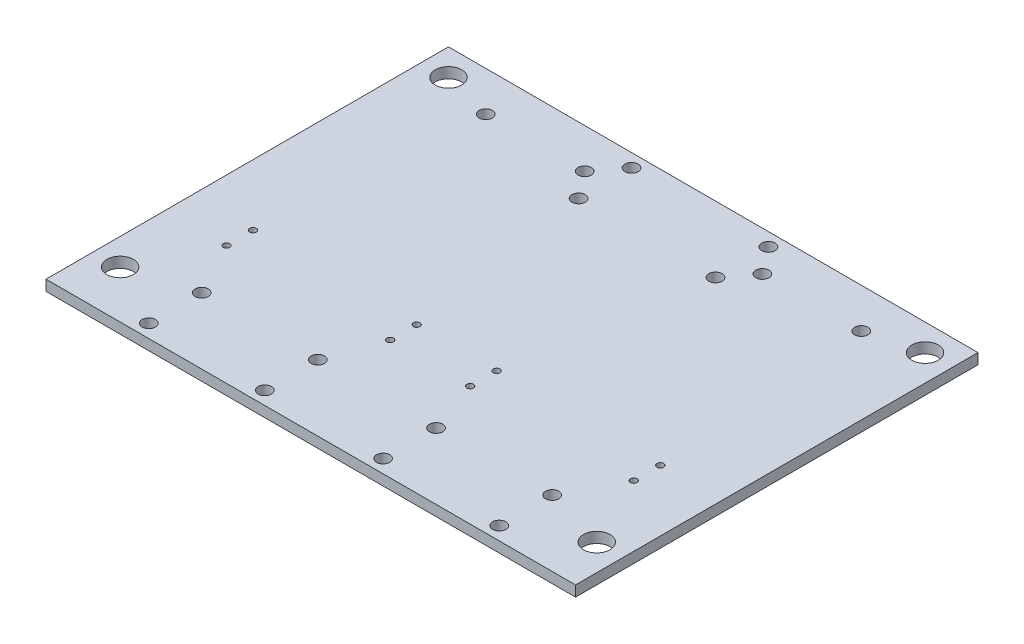
ISO-10303-21;
HEADER;
FILE_DESCRIPTION(('STEP AP214'),'2;1');
FILE_NAME('part.step','',(''),(''),'','','');
FILE_SCHEMA(('AUTOMOTIVE_DESIGN { 1 0 10303 214 1 1 1 1 }'));
ENDSEC;
DATA;
#1=APPLICATION_CONTEXT('core data for automotive mechanical design processes');
#2=APPLICATION_PROTOCOL_DEFINITION('international standard','automotive_design',2000,#1);
#3=PRODUCT_CONTEXT('',#1,'mechanical');
#4=PRODUCT('Part','Part','',(#3));
#5=PRODUCT_RELATED_PRODUCT_CATEGORY('part','',(#4));
#6=PRODUCT_DEFINITION_FORMATION('','',#4);
#7=PRODUCT_DEFINITION_CONTEXT('part definition',#1,'design');
#8=PRODUCT_DEFINITION('design','',#6,#7);
#9=PRODUCT_DEFINITION_SHAPE('','',#8);
#10=(LENGTH_UNIT() NAMED_UNIT(*) SI_UNIT(.MILLI.,.METRE.));
#11=(NAMED_UNIT(*) PLANE_ANGLE_UNIT() SI_UNIT($,.RADIAN.));
#12=(NAMED_UNIT(*) SI_UNIT($,.STERADIAN.) SOLID_ANGLE_UNIT());
#13=UNCERTAINTY_MEASURE_WITH_UNIT(LENGTH_MEASURE(1.E-05),#10,'distance_accuracy_value','');
#14=(GEOMETRIC_REPRESENTATION_CONTEXT(3) GLOBAL_UNCERTAINTY_ASSIGNED_CONTEXT((#13)) GLOBAL_UNIT_ASSIGNED_CONTEXT((#10,
#11,#12)) REPRESENTATION_CONTEXT('',''));
#15=CARTESIAN_POINT('',(0.,0.,0.));
#16=DIRECTION('',(0.,0.,1.));
#17=DIRECTION('',(1.,0.,0.));
#18=AXIS2_PLACEMENT_3D('',#15,#16,#17);
#19=CARTESIAN_POINT('',(-127.,2.53999999999998,203.2));
#20=DIRECTION('',(1.,0.,0.));
#21=DIRECTION('',(0.,0.,-1.));
#22=AXIS2_PLACEMENT_3D('',#19,#20,#21);
#23=PLANE('',#22);
#24=DIRECTION('',(0.,0.,-1.));
#25=VECTOR('',#24,1.);
#26=CARTESIAN_POINT('',(-127.,2.53999999999998,203.2));
#27=LINE('',#26,#25);
#28=CARTESIAN_POINT('',(-127.,2.53999999999998,203.2));
#29=VERTEX_POINT('',#28);
#30=CARTESIAN_POINT('',(-127.,2.53999999999998,10.16));
#31=VERTEX_POINT('',#30);
#32=EDGE_CURVE('E85',#29,#31,#27,.T.);
#33=ORIENTED_EDGE('',*,*,#32,.T.);
#34=DIRECTION('',(0.,1.,0.));
#35=VECTOR('',#34,1.);
#36=CARTESIAN_POINT('',(-127.,-2.54100000000013,10.16));
#37=LINE('',#36,#35);
#38=CARTESIAN_POINT('',(-127.,-2.54000000000002,10.16));
#39=VERTEX_POINT('',#38);
#40=EDGE_CURVE('E47',#39,#31,#37,.T.);
#41=ORIENTED_EDGE('',*,*,#40,.F.);
#42=DIRECTION('',(0.,0.,-1.));
#43=VECTOR('',#42,1.);
#44=CARTESIAN_POINT('',(-127.,-2.54000000000002,203.2));
#45=LINE('',#44,#43);
#46=CARTESIAN_POINT('',(-127.,-2.54000000000002,203.2));
#47=VERTEX_POINT('',#46);
#48=EDGE_CURVE('E11',#47,#39,#45,.T.);
#49=ORIENTED_EDGE('',*,*,#48,.F.);
#50=DIRECTION('',(0.,-1.,0.));
#51=VECTOR('',#50,1.);
#52=CARTESIAN_POINT('',(-127.,2.53999999999998,203.2));
#53=LINE('',#52,#51);
#54=EDGE_CURVE('E92',#29,#47,#53,.T.);
#55=ORIENTED_EDGE('',*,*,#54,.F.);
#56=EDGE_LOOP('',(#33,#41,#49,#55));
#57=FACE_BOUND('',#56,.T.);
#58=ADVANCED_FACE('F33',(#57),#23,.F.);
#59=CARTESIAN_POINT('',(127.,-2.53999999999998,203.2));
#60=DIRECTION('',(0.,1.,0.));
#61=DIRECTION('',(-1.,0.,0.));
#62=AXIS2_PLACEMENT_3D('',#59,#60,#61);
#63=PLANE('',#62);
#64=CARTESIAN_POINT('',(28.3573998719999,-2.54,171.45));
#65=DIRECTION('',(0.,1.,0.));
#66=DIRECTION('',(-1.,0.,0.));
#67=AXIS2_PLACEMENT_3D('',#64,#65,#66);
#68=CIRCLE('',#67,3.175);
#69=CARTESIAN_POINT('',(25.182399872,-2.54,171.45));
#70=VERTEX_POINT('',#69);
#71=EDGE_CURVE('E273',#70,#70,#68,.T.);
#72=ORIENTED_EDGE('',*,*,#71,.T.);
#73=EDGE_LOOP('',(#72));
#74=FACE_BOUND('',#73,.T.);
#75=CARTESIAN_POINT('',(28.3573998719999,-2.54,196.85));
#76=DIRECTION('',(0.,1.,0.));
#77=DIRECTION('',(-1.,0.,0.));
#78=AXIS2_PLACEMENT_3D('',#75,#76,#77);
#79=CIRCLE('',#78,3.175);
#80=CARTESIAN_POINT('',(25.182399872,-2.54,196.85));
#81=VERTEX_POINT('',#80);
#82=EDGE_CURVE('E277',#81,#81,#79,.T.);
#83=ORIENTED_EDGE('',*,*,#82,.T.);
#84=EDGE_LOOP('',(#83));
#85=FACE_BOUND('',#84,.T.);
#86=CARTESIAN_POINT('',(-28.3573998719999,-2.54,171.45));
#87=DIRECTION('',(0.,1.,0.));
#88=DIRECTION('',(-1.,0.,0.));
#89=AXIS2_PLACEMENT_3D('',#86,#87,#88);
#90=CIRCLE('',#89,3.175);
#91=CARTESIAN_POINT('',(-31.5323998719999,-2.54,171.45));
#92=VERTEX_POINT('',#91);
#93=EDGE_CURVE('E281',#92,#92,#90,.F.);
#94=ORIENTED_EDGE('',*,*,#93,.F.);
#95=EDGE_LOOP('',(#94));
#96=FACE_BOUND('',#95,.T.);
#97=CARTESIAN_POINT('',(-28.3573998719999,-2.54,196.85));
#98=DIRECTION('',(0.,1.,0.));
#99=DIRECTION('',(-1.,0.,0.));
#100=AXIS2_PLACEMENT_3D('',#97,#98,#99);
#101=CIRCLE('',#100,3.175);
#102=CARTESIAN_POINT('',(-31.5323998719999,-2.54,196.85));
#103=VERTEX_POINT('',#102);
#104=EDGE_CURVE('E285',#103,#103,#101,.F.);
#105=ORIENTED_EDGE('',*,*,#104,.F.);
#106=EDGE_LOOP('',(#105));
#107=FACE_BOUND('',#106,.T.);
#108=CARTESIAN_POINT('',(-84.0486,-2.54000000000011,196.85));
#109=DIRECTION('',(0.,-1.,0.));
#110=DIRECTION('',(1.,0.,0.));
#111=AXIS2_PLACEMENT_3D('',#108,#109,#110);
#112=CIRCLE('',#111,3.175);
#113=CARTESIAN_POINT('',(-80.8736,-2.54000000000011,196.85));
#114=VERTEX_POINT('',#113);
#115=EDGE_CURVE('E289',#114,#114,#112,.T.);
#116=ORIENTED_EDGE('',*,*,#115,.F.);
#117=EDGE_LOOP('',(#116));
#118=FACE_BOUND('',#117,.T.);
#119=CARTESIAN_POINT('',(-84.0486,-2.54000000000011,171.45));
#120=DIRECTION('',(0.,-1.,0.));
#121=DIRECTION('',(1.,0.,0.));
#122=AXIS2_PLACEMENT_3D('',#119,#120,#121);
#123=CIRCLE('',#122,3.175);
#124=CARTESIAN_POINT('',(-80.8736,-2.54000000000011,171.45));
#125=VERTEX_POINT('',#124);
#126=EDGE_CURVE('E293',#125,#125,#123,.T.);
#127=ORIENTED_EDGE('',*,*,#126,.F.);
#128=EDGE_LOOP('',(#127));
#129=FACE_BOUND('',#128,.T.);
#130=CARTESIAN_POINT('',(84.0486,-2.5400000000001,196.85));
#131=DIRECTION('',(0.,1.,0.));
#132=DIRECTION('',(-1.,0.,0.));
#133=AXIS2_PLACEMENT_3D('',#130,#131,#132);
#134=CIRCLE('',#133,3.175);
#135=CARTESIAN_POINT('',(80.8736,-2.5400000000001,196.85));
#136=VERTEX_POINT('',#135);
#137=EDGE_CURVE('E112',#136,#136,#134,.T.);
#138=ORIENTED_EDGE('',*,*,#137,.T.);
#139=EDGE_LOOP('',(#138));
#140=FACE_BOUND('',#139,.T.);
#141=CARTESIAN_POINT('',(84.0486,-2.5400000000001,171.45));
#142=DIRECTION('',(0.,1.,0.));
#143=DIRECTION('',(-1.,0.,0.));
#144=AXIS2_PLACEMENT_3D('',#141,#142,#143);
#145=CIRCLE('',#144,3.175);
#146=CARTESIAN_POINT('',(80.8736,-2.5400000000001,171.45));
#147=VERTEX_POINT('',#146);
#148=EDGE_CURVE('E299',#147,#147,#145,.T.);
#149=ORIENTED_EDGE('',*,*,#148,.T.);
#150=EDGE_LOOP('',(#149));
#151=FACE_BOUND('',#150,.T.);
#152=CARTESIAN_POINT('',(32.832800096,-2.54,16.51));
#153=DIRECTION('',(0.,1.,0.));
#154=DIRECTION('',(-1.,0.,0.));
#155=AXIS2_PLACEMENT_3D('',#152,#153,#154);
#156=CIRCLE('',#155,3.175);
#157=CARTESIAN_POINT('',(29.657800096,-2.54,16.51));
#158=VERTEX_POINT('',#157);
#159=EDGE_CURVE('E126',#158,#158,#156,.T.);
#160=ORIENTED_EDGE('',*,*,#159,.T.);
#161=EDGE_LOOP('',(#160));
#162=FACE_BOUND('',#161,.T.);
#163=CARTESIAN_POINT('',(32.832800096,-2.54,41.91));
#164=DIRECTION('',(0.,1.,0.));
#165=DIRECTION('',(-1.,0.,0.));
#166=AXIS2_PLACEMENT_3D('',#163,#164,#165);
#167=CIRCLE('',#166,3.175);
#168=CARTESIAN_POINT('',(29.657800096,-2.54,41.91));
#169=VERTEX_POINT('',#168);
#170=EDGE_CURVE('E79',#169,#169,#167,.T.);
#171=ORIENTED_EDGE('',*,*,#170,.T.);
#172=EDGE_LOOP('',(#171));
#173=FACE_BOUND('',#172,.T.);
#174=CARTESIAN_POINT('',(90.0557,-2.5400000000001,29.21));
#175=DIRECTION('',(0.,-1.,0.));
#176=DIRECTION('',(1.,0.,0.));
#177=AXIS2_PLACEMENT_3D('',#174,#175,#176);
#178=CIRCLE('',#177,3.175);
#179=CARTESIAN_POINT('',(93.2307,-2.5400000000001,29.21));
#180=VERTEX_POINT('',#179);
#181=EDGE_CURVE('E134',#180,#180,#178,.T.);
#182=ORIENTED_EDGE('',*,*,#181,.F.);
#183=EDGE_LOOP('',(#182));
#184=FACE_BOUND('',#183,.T.);
#185=CARTESIAN_POINT('',(42.6212,-2.54000000000009,29.21));
#186=DIRECTION('',(0.,-1.,0.));
#187=DIRECTION('',(1.,0.,0.));
#188=AXIS2_PLACEMENT_3D('',#185,#186,#187);
#189=CIRCLE('',#188,3.175);
#190=CARTESIAN_POINT('',(45.7962,-2.54000000000009,29.21));
#191=VERTEX_POINT('',#190);
#192=EDGE_CURVE('E141',#191,#191,#189,.T.);
#193=ORIENTED_EDGE('',*,*,#192,.F.);
#194=EDGE_LOOP('',(#193));
#195=FACE_BOUND('',#194,.T.);
#196=CARTESIAN_POINT('',(-32.832800096,-2.54,16.51));
#197=DIRECTION('',(0.,1.,0.));
#198=DIRECTION('',(-1.,0.,0.));
#199=AXIS2_PLACEMENT_3D('',#196,#197,#198);
#200=CIRCLE('',#199,3.175);
#201=CARTESIAN_POINT('',(-36.007800096,-2.54,16.51));
#202=VERTEX_POINT('',#201);
#203=EDGE_CURVE('E149',#202,#202,#200,.F.);
#204=ORIENTED_EDGE('',*,*,#203,.F.);
#205=EDGE_LOOP('',(#204));
#206=FACE_BOUND('',#205,.T.);
#207=CARTESIAN_POINT('',(-32.832800096,-2.54,41.91));
#208=DIRECTION('',(0.,1.,0.));
#209=DIRECTION('',(-1.,0.,0.));
#210=AXIS2_PLACEMENT_3D('',#207,#208,#209);
#211=CIRCLE('',#210,3.175);
#212=CARTESIAN_POINT('',(-36.007800096,-2.54,41.91));
#213=VERTEX_POINT('',#212);
#214=EDGE_CURVE('E150',#213,#213,#211,.F.);
#215=ORIENTED_EDGE('',*,*,#214,.F.);
#216=EDGE_LOOP('',(#215));
#217=FACE_BOUND('',#216,.T.);
#218=CARTESIAN_POINT('',(-90.0557,-2.54000000000007,29.21));
#219=DIRECTION('',(0.,1.,0.));
#220=DIRECTION('',(-1.,0.,0.));
#221=AXIS2_PLACEMENT_3D('',#218,#219,#220);
#222=CIRCLE('',#221,3.175);
#223=CARTESIAN_POINT('',(-93.2307,-2.54000000000007,29.21));
#224=VERTEX_POINT('',#223);
#225=EDGE_CURVE('E158',#224,#224,#222,.T.);
#226=ORIENTED_EDGE('',*,*,#225,.T.);
#227=EDGE_LOOP('',(#226));
#228=FACE_BOUND('',#227,.T.);
#229=CARTESIAN_POINT('',(-42.6212,-2.54000000000007,29.21));
#230=DIRECTION('',(0.,1.,0.));
#231=DIRECTION('',(-1.,0.,0.));
#232=AXIS2_PLACEMENT_3D('',#229,#230,#231);
#233=CIRCLE('',#232,3.175);
#234=CARTESIAN_POINT('',(-45.7962,-2.54000000000007,29.21));
#235=VERTEX_POINT('',#234);
#236=EDGE_CURVE('E165',#235,#235,#233,.T.);
#237=ORIENTED_EDGE('',*,*,#236,.T.);
#238=EDGE_LOOP('',(#237));
#239=FACE_BOUND('',#238,.T.);
#240=CARTESIAN_POINT('',(97.63,-2.53999999999999,133.2));
#241=DIRECTION('',(0.,1.,0.));
#242=DIRECTION('',(-1.,0.,0.));
#243=AXIS2_PLACEMENT_3D('',#240,#241,#242);
#244=CIRCLE('',#243,1.58749999999999);
#245=CARTESIAN_POINT('',(96.0425,-2.53999999999999,133.2));
#246=VERTEX_POINT('',#245);
#247=EDGE_CURVE('E214',#246,#246,#244,.T.);
#248=ORIENTED_EDGE('',*,*,#247,.T.);
#249=EDGE_LOOP('',(#248));
#250=FACE_BOUND('',#249,.T.);
#251=CARTESIAN_POINT('',(97.63,-2.53999999999999,145.9));
#252=DIRECTION('',(0.,1.,0.));
#253=DIRECTION('',(-1.,0.,0.));
#254=AXIS2_PLACEMENT_3D('',#251,#252,#253);
#255=CIRCLE('',#254,1.58749999999999);
#256=CARTESIAN_POINT('',(96.0425,-2.53999999999999,145.9));
#257=VERTEX_POINT('',#256);
#258=EDGE_CURVE('E211',#257,#257,#255,.T.);
#259=ORIENTED_EDGE('',*,*,#258,.T.);
#260=EDGE_LOOP('',(#259));
#261=FACE_BOUND('',#260,.T.);
#262=CARTESIAN_POINT('',(-19.21,-2.54000000000001,133.2));
#263=DIRECTION('',(0.,1.,0.));
#264=DIRECTION('',(-1.,0.,0.));
#265=AXIS2_PLACEMENT_3D('',#262,#263,#264);
#266=CIRCLE('',#265,1.5875);
#267=CARTESIAN_POINT('',(-20.7975,-2.54000000000001,133.2));
#268=VERTEX_POINT('',#267);
#269=EDGE_CURVE('E208',#268,#268,#266,.T.);
#270=ORIENTED_EDGE('',*,*,#269,.T.);
#271=EDGE_LOOP('',(#270));
#272=FACE_BOUND('',#271,.T.);
#273=CARTESIAN_POINT('',(-19.21,-2.54000000000001,145.9));
#274=DIRECTION('',(0.,1.,0.));
#275=DIRECTION('',(-1.,0.,0.));
#276=AXIS2_PLACEMENT_3D('',#273,#274,#275);
#277=CIRCLE('',#276,1.5875);
#278=CARTESIAN_POINT('',(-20.7975,-2.54000000000001,145.9));
#279=VERTEX_POINT('',#278);
#280=EDGE_CURVE('E205',#279,#279,#277,.T.);
#281=ORIENTED_EDGE('',*,*,#280,.T.);
#282=EDGE_LOOP('',(#281));
#283=FACE_BOUND('',#282,.T.);
#284=CARTESIAN_POINT('',(19.144,-2.53999999999999,145.9));
#285=DIRECTION('',(0.,1.,0.));
#286=DIRECTION('',(-1.,0.,0.));
#287=AXIS2_PLACEMENT_3D('',#284,#285,#286);
#288=CIRCLE('',#287,1.5875);
#289=CARTESIAN_POINT('',(17.5565,-2.53999999999999,145.9));
#290=VERTEX_POINT('',#289);
#291=EDGE_CURVE('E202',#290,#290,#288,.T.);
#292=ORIENTED_EDGE('',*,*,#291,.T.);
#293=EDGE_LOOP('',(#292));
#294=FACE_BOUND('',#293,.T.);
#295=CARTESIAN_POINT('',(19.144,-2.53999999999999,133.2));
#296=DIRECTION('',(0.,1.,0.));
#297=DIRECTION('',(-1.,0.,0.));
#298=AXIS2_PLACEMENT_3D('',#295,#296,#297);
#299=CIRCLE('',#298,1.5875);
#300=CARTESIAN_POINT('',(17.5565,-2.53999999999999,133.2));
#301=VERTEX_POINT('',#300);
#302=EDGE_CURVE('E199',#301,#301,#299,.T.);
#303=ORIENTED_EDGE('',*,*,#302,.T.);
#304=EDGE_LOOP('',(#303));
#305=FACE_BOUND('',#304,.T.);
#306=CARTESIAN_POINT('',(-97.696,-2.54000000000001,145.9));
#307=DIRECTION('',(0.,1.,0.));
#308=DIRECTION('',(-1.,0.,0.));
#309=AXIS2_PLACEMENT_3D('',#306,#307,#308);
#310=CIRCLE('',#309,1.58749999999999);
#311=CARTESIAN_POINT('',(-99.2835,-2.54000000000001,145.9));
#312=VERTEX_POINT('',#311);
#313=EDGE_CURVE('E196',#312,#312,#310,.T.);
#314=ORIENTED_EDGE('',*,*,#313,.T.);
#315=EDGE_LOOP('',(#314));
#316=FACE_BOUND('',#315,.T.);
#317=CARTESIAN_POINT('',(-97.696,-2.54000000000001,133.2));
#318=DIRECTION('',(0.,1.,0.));
#319=DIRECTION('',(-1.,0.,0.));
#320=AXIS2_PLACEMENT_3D('',#317,#318,#319);
#321=CIRCLE('',#320,1.58749999999999);
#322=CARTESIAN_POINT('',(-99.2835,-2.54000000000001,133.2));
#323=VERTEX_POINT('',#322);
#324=EDGE_CURVE('E193',#323,#323,#321,.T.);
#325=ORIENTED_EDGE('',*,*,#324,.T.);
#326=EDGE_LOOP('',(#325));
#327=FACE_BOUND('',#326,.T.);
#328=CARTESIAN_POINT('',(-114.3,-2.54000000000004,180.34));
#329=DIRECTION('',(0.,1.,0.));
#330=DIRECTION('',(-1.,0.,0.));
#331=AXIS2_PLACEMENT_3D('',#328,#329,#330);
#332=CIRCLE('',#331,6.34999999999999);
#333=CARTESIAN_POINT('',(-120.65,-2.54000000000005,180.34));
#334=VERTEX_POINT('',#333);
#335=EDGE_CURVE('E224',#334,#334,#332,.T.);
#336=ORIENTED_EDGE('',*,*,#335,.T.);
#337=EDGE_LOOP('',(#336));
#338=FACE_BOUND('',#337,.T.);
#339=CARTESIAN_POINT('',(114.3,-2.54000000000002,22.86));
#340=DIRECTION('',(0.,1.,0.));
#341=DIRECTION('',(-1.,0.,0.));
#342=AXIS2_PLACEMENT_3D('',#339,#340,#341);
#343=CIRCLE('',#342,6.35);
#344=CARTESIAN_POINT('',(107.95,-2.54000000000002,22.86));
#345=VERTEX_POINT('',#344);
#346=EDGE_CURVE('E230',#345,#345,#343,.T.);
#347=ORIENTED_EDGE('',*,*,#346,.T.);
#348=EDGE_LOOP('',(#347));
#349=FACE_BOUND('',#348,.T.);
#350=CARTESIAN_POINT('',(114.3,-2.54000000000002,180.34));
#351=DIRECTION('',(0.,1.,0.));
#352=DIRECTION('',(-1.,0.,0.));
#353=AXIS2_PLACEMENT_3D('',#350,#351,#352);
#354=CIRCLE('',#353,6.34999999999999);
#355=CARTESIAN_POINT('',(107.95,-2.54000000000002,180.34));
#356=VERTEX_POINT('',#355);
#357=EDGE_CURVE('E218',#356,#356,#354,.T.);
#358=ORIENTED_EDGE('',*,*,#357,.T.);
#359=EDGE_LOOP('',(#358));
#360=FACE_BOUND('',#359,.T.);
#361=CARTESIAN_POINT('',(-114.3,-2.54000000000004,22.86));
#362=DIRECTION('',(0.,1.,0.));
#363=DIRECTION('',(-1.,0.,0.));
#364=AXIS2_PLACEMENT_3D('',#361,#362,#363);
#365=CIRCLE('',#364,6.35);
#366=CARTESIAN_POINT('',(-120.65,-2.54000000000005,22.86));
#367=VERTEX_POINT('',#366);
#368=EDGE_CURVE('E95',#367,#367,#365,.T.);
#369=ORIENTED_EDGE('',*,*,#368,.T.);
#370=EDGE_LOOP('',(#369));
#371=FACE_BOUND('',#370,.T.);
#372=ORIENTED_EDGE('',*,*,#48,.T.);
#373=DIRECTION('',(-1.,0.,0.));
#374=VECTOR('',#373,1.);
#375=CARTESIAN_POINT('',(-127.,-2.54000000000002,10.16));
#376=LINE('',#375,#374);
#377=CARTESIAN_POINT('',(127.,-2.53999999999998,10.16));
#378=VERTEX_POINT('',#377);
#379=EDGE_CURVE('E72',#378,#39,#376,.T.);
#380=ORIENTED_EDGE('',*,*,#379,.F.);
#381=DIRECTION('',(0.,0.,-1.));
#382=VECTOR('',#381,1.);
#383=CARTESIAN_POINT('',(127.,-2.53999999999998,203.2));
#384=LINE('',#383,#382);
#385=CARTESIAN_POINT('',(127.,-2.53999999999998,203.2));
#386=VERTEX_POINT('',#385);
#387=EDGE_CURVE('E40',#386,#378,#384,.T.);
#388=ORIENTED_EDGE('',*,*,#387,.F.);
#389=DIRECTION('',(1.,0.,0.));
#390=VECTOR('',#389,1.);
#391=CARTESIAN_POINT('',(127.,-2.53999999999998,203.2));
#392=LINE('',#391,#390);
#393=EDGE_CURVE('E89',#47,#386,#392,.T.);
#394=ORIENTED_EDGE('',*,*,#393,.F.);
#395=EDGE_LOOP('',(#372,#380,#388,#394));
#396=FACE_BOUND('',#395,.T.);
#397=ADVANCED_FACE('F88',(#74,#85,#96,#107,#118,#129,#140,#151,#162,#173,#184,#195,#206,#217,
#228,#239,#250,#261,#272,#283,#294,#305,#316,#327,#338,#349,#360,#371,#396),#63,.F.);
#398=CARTESIAN_POINT('',(127.,2.54000000000002,203.2));
#399=DIRECTION('',(-1.,0.,0.));
#400=DIRECTION('',(0.,0.,1.));
#401=AXIS2_PLACEMENT_3D('',#398,#399,#400);
#402=PLANE('',#401);
#403=ORIENTED_EDGE('',*,*,#387,.T.);
#404=DIRECTION('',(0.,1.,0.));
#405=VECTOR('',#404,1.);
#406=CARTESIAN_POINT('',(127.,-2.5410000000001,10.16));
#407=LINE('',#406,#405);
#408=CARTESIAN_POINT('',(127.,2.54000000000002,10.16));
#409=VERTEX_POINT('',#408);
#410=EDGE_CURVE('E75',#378,#409,#407,.T.);
#411=ORIENTED_EDGE('',*,*,#410,.T.);
#412=DIRECTION('',(0.,0.,-1.));
#413=VECTOR('',#412,1.);
#414=CARTESIAN_POINT('',(127.,2.54000000000002,203.2));
#415=LINE('',#414,#413);
#416=CARTESIAN_POINT('',(127.,2.54000000000002,203.2));
#417=VERTEX_POINT('',#416);
#418=EDGE_CURVE('E105',#417,#409,#415,.T.);
#419=ORIENTED_EDGE('',*,*,#418,.F.);
#420=DIRECTION('',(0.,1.,0.));
#421=VECTOR('',#420,1.);
#422=CARTESIAN_POINT('',(127.,2.54000000000002,203.2));
#423=LINE('',#422,#421);
#424=EDGE_CURVE('E91',#386,#417,#423,.T.);
#425=ORIENTED_EDGE('',*,*,#424,.F.);
#426=EDGE_LOOP('',(#403,#411,#419,#425));
#427=FACE_BOUND('',#426,.T.);
#428=ADVANCED_FACE('F108',(#427),#402,.F.);
#429=CARTESIAN_POINT('',(127.,2.54000000000002,203.2));
#430=DIRECTION('',(0.,-1.,0.));
#431=DIRECTION('',(1.,0.,0.));
#432=AXIS2_PLACEMENT_3D('',#429,#430,#431);
#433=PLANE('',#432);
#434=CARTESIAN_POINT('',(28.3573998719999,2.54,171.45));
#435=DIRECTION('',(0.,-1.,0.));
#436=DIRECTION('',(1.,0.,0.));
#437=AXIS2_PLACEMENT_3D('',#434,#435,#436);
#438=CIRCLE('',#437,3.175);
#439=CARTESIAN_POINT('',(31.5323998719999,2.54,171.45));
#440=VERTEX_POINT('',#439);
#441=EDGE_CURVE('E450',#440,#440,#438,.T.);
#442=ORIENTED_EDGE('',*,*,#441,.T.);
#443=EDGE_LOOP('',(#442));
#444=FACE_BOUND('',#443,.T.);
#445=CARTESIAN_POINT('',(28.3573998719999,2.54,196.85));
#446=DIRECTION('',(0.,-1.,0.));
#447=DIRECTION('',(1.,0.,0.));
#448=AXIS2_PLACEMENT_3D('',#445,#446,#447);
#449=CIRCLE('',#448,3.175);
#450=CARTESIAN_POINT('',(31.5323998719999,2.54,196.85));
#451=VERTEX_POINT('',#450);
#452=EDGE_CURVE('E451',#451,#451,#449,.T.);
#453=ORIENTED_EDGE('',*,*,#452,.T.);
#454=EDGE_LOOP('',(#453));
#455=FACE_BOUND('',#454,.T.);
#456=CARTESIAN_POINT('',(-28.3573998719999,2.54,171.45));
#457=DIRECTION('',(0.,1.,0.));
#458=DIRECTION('',(-1.,0.,0.));
#459=AXIS2_PLACEMENT_3D('',#456,#457,#458);
#460=CIRCLE('',#459,3.175);
#461=CARTESIAN_POINT('',(-31.5323998719999,2.54,171.45));
#462=VERTEX_POINT('',#461);
#463=EDGE_CURVE('E459',#462,#462,#460,.T.);
#464=ORIENTED_EDGE('',*,*,#463,.F.);
#465=EDGE_LOOP('',(#464));
#466=FACE_BOUND('',#465,.T.);
#467=CARTESIAN_POINT('',(-28.3573998719999,2.54,196.85));
#468=DIRECTION('',(0.,1.,0.));
#469=DIRECTION('',(-1.,0.,0.));
#470=AXIS2_PLACEMENT_3D('',#467,#468,#469);
#471=CIRCLE('',#470,3.175);
#472=CARTESIAN_POINT('',(-31.5323998719999,2.54,196.85));
#473=VERTEX_POINT('',#472);
#474=EDGE_CURVE('E453',#473,#473,#471,.T.);
#475=ORIENTED_EDGE('',*,*,#474,.F.);
#476=EDGE_LOOP('',(#475));
#477=FACE_BOUND('',#476,.T.);
#478=CARTESIAN_POINT('',(-84.0486,2.54000000000001,196.85));
#479=DIRECTION('',(0.,-1.,0.));
#480=DIRECTION('',(1.,0.,0.));
#481=AXIS2_PLACEMENT_3D('',#478,#479,#480);
#482=CIRCLE('',#481,3.175);
#483=CARTESIAN_POINT('',(-80.8736,2.54000000000001,196.85));
#484=VERTEX_POINT('',#483);
#485=EDGE_CURVE('E468',#484,#484,#482,.T.);
#486=ORIENTED_EDGE('',*,*,#485,.T.);
#487=EDGE_LOOP('',(#486));
#488=FACE_BOUND('',#487,.T.);
#489=CARTESIAN_POINT('',(-84.0486,2.54000000000001,171.45));
#490=DIRECTION('',(0.,-1.,0.));
#491=DIRECTION('',(1.,0.,0.));
#492=AXIS2_PLACEMENT_3D('',#489,#490,#491);
#493=CIRCLE('',#492,3.175);
#494=CARTESIAN_POINT('',(-80.8736,2.54000000000001,171.45));
#495=VERTEX_POINT('',#494);
#496=EDGE_CURVE('E463',#495,#495,#493,.T.);
#497=ORIENTED_EDGE('',*,*,#496,.T.);
#498=EDGE_LOOP('',(#497));
#499=FACE_BOUND('',#498,.T.);
#500=CARTESIAN_POINT('',(84.0486,2.54000000000001,196.85));
#501=DIRECTION('',(0.,1.,0.));
#502=DIRECTION('',(-1.,0.,0.));
#503=AXIS2_PLACEMENT_3D('',#500,#501,#502);
#504=CIRCLE('',#503,3.175);
#505=CARTESIAN_POINT('',(80.8736,2.54000000000001,196.85));
#506=VERTEX_POINT('',#505);
#507=EDGE_CURVE('E115',#506,#506,#504,.T.);
#508=ORIENTED_EDGE('',*,*,#507,.F.);
#509=EDGE_LOOP('',(#508));
#510=FACE_BOUND('',#509,.T.);
#511=CARTESIAN_POINT('',(84.0486,2.54000000000001,171.45));
#512=DIRECTION('',(0.,1.,0.));
#513=DIRECTION('',(-1.,0.,0.));
#514=AXIS2_PLACEMENT_3D('',#511,#512,#513);
#515=CIRCLE('',#514,3.175);
#516=CARTESIAN_POINT('',(80.8736,2.54000000000001,171.45));
#517=VERTEX_POINT('',#516);
#518=EDGE_CURVE('E119',#517,#517,#515,.T.);
#519=ORIENTED_EDGE('',*,*,#518,.F.);
#520=EDGE_LOOP('',(#519));
#521=FACE_BOUND('',#520,.T.);
#522=CARTESIAN_POINT('',(32.832800096,2.54,16.51));
#523=DIRECTION('',(0.,-1.,0.));
#524=DIRECTION('',(1.,0.,0.));
#525=AXIS2_PLACEMENT_3D('',#522,#523,#524);
#526=CIRCLE('',#525,3.175);
#527=CARTESIAN_POINT('',(36.007800096,2.54,16.51));
#528=VERTEX_POINT('',#527);
#529=EDGE_CURVE('E122',#528,#528,#526,.T.);
#530=ORIENTED_EDGE('',*,*,#529,.T.);
#531=EDGE_LOOP('',(#530));
#532=FACE_BOUND('',#531,.T.);
#533=CARTESIAN_POINT('',(32.832800096,2.54,41.91));
#534=DIRECTION('',(0.,-1.,0.));
#535=DIRECTION('',(1.,0.,0.));
#536=AXIS2_PLACEMENT_3D('',#533,#534,#535);
#537=CIRCLE('',#536,3.175);
#538=CARTESIAN_POINT('',(36.007800096,2.54,41.91));
#539=VERTEX_POINT('',#538);
#540=EDGE_CURVE('E129',#539,#539,#537,.T.);
#541=ORIENTED_EDGE('',*,*,#540,.T.);
#542=EDGE_LOOP('',(#541));
#543=FACE_BOUND('',#542,.T.);
#544=CARTESIAN_POINT('',(90.0557,2.53999999999999,29.21));
#545=DIRECTION('',(0.,-1.,0.));
#546=DIRECTION('',(1.,0.,0.));
#547=AXIS2_PLACEMENT_3D('',#544,#545,#546);
#548=CIRCLE('',#547,3.175);
#549=CARTESIAN_POINT('',(93.2307,2.53999999999999,29.21));
#550=VERTEX_POINT('',#549);
#551=EDGE_CURVE('E138',#550,#550,#548,.T.);
#552=ORIENTED_EDGE('',*,*,#551,.T.);
#553=EDGE_LOOP('',(#552));
#554=FACE_BOUND('',#553,.T.);
#555=CARTESIAN_POINT('',(42.6212,2.54,29.21));
#556=DIRECTION('',(0.,-1.,0.));
#557=DIRECTION('',(1.,0.,0.));
#558=AXIS2_PLACEMENT_3D('',#555,#556,#557);
#559=CIRCLE('',#558,3.175);
#560=CARTESIAN_POINT('',(45.7962,2.54,29.21));
#561=VERTEX_POINT('',#560);
#562=EDGE_CURVE('E125',#561,#561,#559,.T.);
#563=ORIENTED_EDGE('',*,*,#562,.T.);
#564=EDGE_LOOP('',(#563));
#565=FACE_BOUND('',#564,.T.);
#566=CARTESIAN_POINT('',(-32.832800096,2.54,16.51));
#567=DIRECTION('',(0.,1.,0.));
#568=DIRECTION('',(-1.,0.,0.));
#569=AXIS2_PLACEMENT_3D('',#566,#567,#568);
#570=CIRCLE('',#569,3.175);
#571=CARTESIAN_POINT('',(-36.007800096,2.54,16.51));
#572=VERTEX_POINT('',#571);
#573=EDGE_CURVE('E146',#572,#572,#570,.T.);
#574=ORIENTED_EDGE('',*,*,#573,.F.);
#575=EDGE_LOOP('',(#574));
#576=FACE_BOUND('',#575,.T.);
#577=CARTESIAN_POINT('',(-32.832800096,2.54,41.91));
#578=DIRECTION('',(0.,1.,0.));
#579=DIRECTION('',(-1.,0.,0.));
#580=AXIS2_PLACEMENT_3D('',#577,#578,#579);
#581=CIRCLE('',#580,3.175);
#582=CARTESIAN_POINT('',(-36.007800096,2.54,41.91));
#583=VERTEX_POINT('',#582);
#584=EDGE_CURVE('E137',#583,#583,#581,.T.);
#585=ORIENTED_EDGE('',*,*,#584,.F.);
#586=EDGE_LOOP('',(#585));
#587=FACE_BOUND('',#586,.T.);
#588=CARTESIAN_POINT('',(-90.0557,2.53999999999999,29.21));
#589=DIRECTION('',(0.,1.,0.));
#590=DIRECTION('',(-1.,0.,0.));
#591=AXIS2_PLACEMENT_3D('',#588,#589,#590);
#592=CIRCLE('',#591,3.175);
#593=CARTESIAN_POINT('',(-93.2307,2.53999999999999,29.21));
#594=VERTEX_POINT('',#593);
#595=EDGE_CURVE('E162',#594,#594,#592,.T.);
#596=ORIENTED_EDGE('',*,*,#595,.F.);
#597=EDGE_LOOP('',(#596));
#598=FACE_BOUND('',#597,.T.);
#599=CARTESIAN_POINT('',(-42.6212,2.54,29.21));
#600=DIRECTION('',(0.,1.,0.));
#601=DIRECTION('',(-1.,0.,0.));
#602=AXIS2_PLACEMENT_3D('',#599,#600,#601);
#603=CIRCLE('',#602,3.175);
#604=CARTESIAN_POINT('',(-45.7962,2.54,29.21));
#605=VERTEX_POINT('',#604);
#606=EDGE_CURVE('E153',#605,#605,#603,.T.);
#607=ORIENTED_EDGE('',*,*,#606,.F.);
#608=EDGE_LOOP('',(#607));
#609=FACE_BOUND('',#608,.T.);
#610=CARTESIAN_POINT('',(97.63,2.54000000000001,133.2));
#611=DIRECTION('',(0.,1.,0.));
#612=DIRECTION('',(-1.,0.,0.));
#613=AXIS2_PLACEMENT_3D('',#610,#611,#612);
#614=CIRCLE('',#613,1.58749999999999);
#615=CARTESIAN_POINT('',(96.0425,2.54000000000001,133.2));
#616=VERTEX_POINT('',#615);
#617=EDGE_CURVE('E179',#616,#616,#614,.T.);
#618=ORIENTED_EDGE('',*,*,#617,.F.);
#619=EDGE_LOOP('',(#618));
#620=FACE_BOUND('',#619,.T.);
#621=CARTESIAN_POINT('',(97.63,2.54000000000001,145.9));
#622=DIRECTION('',(0.,1.,0.));
#623=DIRECTION('',(-1.,0.,0.));
#624=AXIS2_PLACEMENT_3D('',#621,#622,#623);
#625=CIRCLE('',#624,1.58749999999999);
#626=CARTESIAN_POINT('',(96.0425,2.54000000000001,145.9));
#627=VERTEX_POINT('',#626);
#628=EDGE_CURVE('E183',#627,#627,#625,.T.);
#629=ORIENTED_EDGE('',*,*,#628,.F.);
#630=EDGE_LOOP('',(#629));
#631=FACE_BOUND('',#630,.T.);
#632=CARTESIAN_POINT('',(-19.21,2.54,133.2));
#633=DIRECTION('',(0.,1.,0.));
#634=DIRECTION('',(-1.,0.,0.));
#635=AXIS2_PLACEMENT_3D('',#632,#633,#634);
#636=CIRCLE('',#635,1.5875);
#637=CARTESIAN_POINT('',(-20.7975,2.54,133.2));
#638=VERTEX_POINT('',#637);
#639=EDGE_CURVE('E186',#638,#638,#636,.T.);
#640=ORIENTED_EDGE('',*,*,#639,.F.);
#641=EDGE_LOOP('',(#640));
#642=FACE_BOUND('',#641,.T.);
#643=CARTESIAN_POINT('',(-19.21,2.54,145.9));
#644=DIRECTION('',(0.,1.,0.));
#645=DIRECTION('',(-1.,0.,0.));
#646=AXIS2_PLACEMENT_3D('',#643,#644,#645);
#647=CIRCLE('',#646,1.5875);
#648=CARTESIAN_POINT('',(-20.7975,2.54,145.9));
#649=VERTEX_POINT('',#648);
#650=EDGE_CURVE('E176',#649,#649,#647,.T.);
#651=ORIENTED_EDGE('',*,*,#650,.F.);
#652=EDGE_LOOP('',(#651));
#653=FACE_BOUND('',#652,.T.);
#654=CARTESIAN_POINT('',(19.144,2.54,145.9));
#655=DIRECTION('',(0.,1.,0.));
#656=DIRECTION('',(-1.,0.,0.));
#657=AXIS2_PLACEMENT_3D('',#654,#655,#656);
#658=CIRCLE('',#657,1.5875);
#659=CARTESIAN_POINT('',(17.5565,2.54,145.9));
#660=VERTEX_POINT('',#659);
#661=EDGE_CURVE('E161',#660,#660,#658,.T.);
#662=ORIENTED_EDGE('',*,*,#661,.F.);
#663=EDGE_LOOP('',(#662));
#664=FACE_BOUND('',#663,.T.);
#665=CARTESIAN_POINT('',(19.144,2.54,133.2));
#666=DIRECTION('',(0.,1.,0.));
#667=DIRECTION('',(-1.,0.,0.));
#668=AXIS2_PLACEMENT_3D('',#665,#666,#667);
#669=CIRCLE('',#668,1.5875);
#670=CARTESIAN_POINT('',(17.5565,2.54,133.2));
#671=VERTEX_POINT('',#670);
#672=EDGE_CURVE('E172',#671,#671,#669,.T.);
#673=ORIENTED_EDGE('',*,*,#672,.F.);
#674=EDGE_LOOP('',(#673));
#675=FACE_BOUND('',#674,.T.);
#676=CARTESIAN_POINT('',(-97.696,2.53999999999999,145.9));
#677=DIRECTION('',(0.,1.,0.));
#678=DIRECTION('',(-1.,0.,0.));
#679=AXIS2_PLACEMENT_3D('',#676,#677,#678);
#680=CIRCLE('',#679,1.58749999999999);
#681=CARTESIAN_POINT('',(-99.2835,2.53999999999999,145.9));
#682=VERTEX_POINT('',#681);
#683=EDGE_CURVE('E173',#682,#682,#680,.T.);
#684=ORIENTED_EDGE('',*,*,#683,.F.);
#685=EDGE_LOOP('',(#684));
#686=FACE_BOUND('',#685,.T.);
#687=CARTESIAN_POINT('',(-97.696,2.53999999999999,133.2));
#688=DIRECTION('',(0.,1.,0.));
#689=DIRECTION('',(-1.,0.,0.));
#690=AXIS2_PLACEMENT_3D('',#687,#688,#689);
#691=CIRCLE('',#690,1.58749999999999);
#692=CARTESIAN_POINT('',(-99.2835,2.53999999999999,133.2));
#693=VERTEX_POINT('',#692);
#694=EDGE_CURVE('E182',#693,#693,#691,.T.);
#695=ORIENTED_EDGE('',*,*,#694,.F.);
#696=EDGE_LOOP('',(#695));
#697=FACE_BOUND('',#696,.T.);
#698=CARTESIAN_POINT('',(-114.3,2.53999999999999,180.34));
#699=DIRECTION('',(0.,1.,0.));
#700=DIRECTION('',(-1.,0.,0.));
#701=AXIS2_PLACEMENT_3D('',#698,#699,#700);
#702=CIRCLE('',#701,6.34999999999999);
#703=CARTESIAN_POINT('',(-120.65,2.53999999999999,180.34));
#704=VERTEX_POINT('',#703);
#705=EDGE_CURVE('E227',#704,#704,#702,.T.);
#706=ORIENTED_EDGE('',*,*,#705,.F.);
#707=EDGE_LOOP('',(#706));
#708=FACE_BOUND('',#707,.T.);
#709=CARTESIAN_POINT('',(114.3,2.54000000000001,22.86));
#710=DIRECTION('',(0.,1.,0.));
#711=DIRECTION('',(-1.,0.,0.));
#712=AXIS2_PLACEMENT_3D('',#709,#710,#711);
#713=CIRCLE('',#712,6.35);
#714=CARTESIAN_POINT('',(107.95,2.54000000000001,22.86));
#715=VERTEX_POINT('',#714);
#716=EDGE_CURVE('E221',#715,#715,#713,.T.);
#717=ORIENTED_EDGE('',*,*,#716,.F.);
#718=EDGE_LOOP('',(#717));
#719=FACE_BOUND('',#718,.T.);
#720=CARTESIAN_POINT('',(114.3,2.54000000000001,180.34));
#721=DIRECTION('',(0.,1.,0.));
#722=DIRECTION('',(-1.,0.,0.));
#723=AXIS2_PLACEMENT_3D('',#720,#721,#722);
#724=CIRCLE('',#723,6.34999999999999);
#725=CARTESIAN_POINT('',(107.95,2.54000000000001,180.34));
#726=VERTEX_POINT('',#725);
#727=EDGE_CURVE('E217',#726,#726,#724,.T.);
#728=ORIENTED_EDGE('',*,*,#727,.F.);
#729=EDGE_LOOP('',(#728));
#730=FACE_BOUND('',#729,.T.);
#731=CARTESIAN_POINT('',(-114.3,2.53999999999999,22.86));
#732=DIRECTION('',(0.,1.,0.));
#733=DIRECTION('',(-1.,0.,0.));
#734=AXIS2_PLACEMENT_3D('',#731,#732,#733);
#735=CIRCLE('',#734,6.35);
#736=CARTESIAN_POINT('',(-120.65,2.53999999999999,22.86));
#737=VERTEX_POINT('',#736);
#738=EDGE_CURVE('E98',#737,#737,#735,.T.);
#739=ORIENTED_EDGE('',*,*,#738,.F.);
#740=EDGE_LOOP('',(#739));
#741=FACE_BOUND('',#740,.T.);
#742=ORIENTED_EDGE('',*,*,#418,.T.);
#743=DIRECTION('',(1.,0.,0.));
#744=VECTOR('',#743,1.);
#745=CARTESIAN_POINT('',(-127.,2.53999999999998,10.16));
#746=LINE('',#745,#744);
#747=EDGE_CURVE('E86',#31,#409,#746,.T.);
#748=ORIENTED_EDGE('',*,*,#747,.F.);
#749=ORIENTED_EDGE('',*,*,#32,.F.);
#750=DIRECTION('',(-1.,0.,0.));
#751=VECTOR('',#750,1.);
#752=CARTESIAN_POINT('',(127.,2.54000000000002,203.2));
#753=LINE('',#752,#751);
#754=EDGE_CURVE('E55',#417,#29,#753,.T.);
#755=ORIENTED_EDGE('',*,*,#754,.F.);
#756=EDGE_LOOP('',(#742,#748,#749,#755));
#757=FACE_BOUND('',#756,.T.);
#758=ADVANCED_FACE('F111',(#444,#455,#466,#477,#488,#499,#510,#521,#532,#543,#554,#565,#576,
#587,#598,#609,#620,#631,#642,#653,#664,#675,#686,#697,#708,#719,#730,#741,#757),#433,.F.);
#759=CARTESIAN_POINT('',(0.,0.,203.2));
#760=DIRECTION('',(0.,0.,-1.));
#761=DIRECTION('',(-1.,0.,0.));
#762=AXIS2_PLACEMENT_3D('',#759,#760,#761);
#763=PLANE('',#762);
#764=ORIENTED_EDGE('',*,*,#54,.T.);
#765=ORIENTED_EDGE('',*,*,#393,.T.);
#766=ORIENTED_EDGE('',*,*,#424,.T.);
#767=ORIENTED_EDGE('',*,*,#754,.T.);
#768=EDGE_LOOP('',(#764,#765,#766,#767));
#769=FACE_BOUND('',#768,.T.);
#770=ADVANCED_FACE('F94',(#769),#763,.F.);
#771=CARTESIAN_POINT('',(-114.3,-2.54000000000004,22.86));
#772=DIRECTION('',(0.,1.,0.));
#773=DIRECTION('',(-1.,0.,0.));
#774=AXIS2_PLACEMENT_3D('',#771,#772,#773);
#775=CYLINDRICAL_SURFACE('',#774,6.35);
#776=ORIENTED_EDGE('',*,*,#368,.F.);
#777=EDGE_LOOP('',(#776));
#778=FACE_BOUND('',#777,.T.);
#779=ORIENTED_EDGE('',*,*,#738,.T.);
#780=EDGE_LOOP('',(#779));
#781=FACE_BOUND('',#780,.T.);
#782=ADVANCED_FACE('F247',(#778,#781),#775,.F.);
#783=CARTESIAN_POINT('',(114.3,-2.54000000000002,180.34));
#784=DIRECTION('',(0.,1.,0.));
#785=DIRECTION('',(-1.,0.,0.));
#786=AXIS2_PLACEMENT_3D('',#783,#784,#785);
#787=CYLINDRICAL_SURFACE('',#786,6.34999999999999);
#788=ORIENTED_EDGE('',*,*,#357,.F.);
#789=EDGE_LOOP('',(#788));
#790=FACE_BOUND('',#789,.T.);
#791=ORIENTED_EDGE('',*,*,#727,.T.);
#792=EDGE_LOOP('',(#791));
#793=FACE_BOUND('',#792,.T.);
#794=ADVANCED_FACE('F249',(#790,#793),#787,.F.);
#795=CARTESIAN_POINT('',(114.3,-2.54000000000002,22.86));
#796=DIRECTION('',(0.,1.,0.));
#797=DIRECTION('',(-1.,0.,0.));
#798=AXIS2_PLACEMENT_3D('',#795,#796,#797);
#799=CYLINDRICAL_SURFACE('',#798,6.35);
#800=ORIENTED_EDGE('',*,*,#346,.F.);
#801=EDGE_LOOP('',(#800));
#802=FACE_BOUND('',#801,.T.);
#803=ORIENTED_EDGE('',*,*,#716,.T.);
#804=EDGE_LOOP('',(#803));
#805=FACE_BOUND('',#804,.T.);
#806=ADVANCED_FACE('F236',(#802,#805),#799,.F.);
#807=CARTESIAN_POINT('',(-114.3,-2.54000000000004,180.34));
#808=DIRECTION('',(0.,1.,0.));
#809=DIRECTION('',(-1.,0.,0.));
#810=AXIS2_PLACEMENT_3D('',#807,#808,#809);
#811=CYLINDRICAL_SURFACE('',#810,6.34999999999999);
#812=ORIENTED_EDGE('',*,*,#335,.F.);
#813=EDGE_LOOP('',(#812));
#814=FACE_BOUND('',#813,.T.);
#815=ORIENTED_EDGE('',*,*,#705,.T.);
#816=EDGE_LOOP('',(#815));
#817=FACE_BOUND('',#816,.T.);
#818=ADVANCED_FACE('F341',(#814,#817),#811,.F.);
#819=CARTESIAN_POINT('',(-97.696,-149.86,133.2));
#820=DIRECTION('',(0.,1.,0.));
#821=DIRECTION('',(-1.,0.,0.));
#822=AXIS2_PLACEMENT_3D('',#819,#820,#821);
#823=CYLINDRICAL_SURFACE('',#822,1.58749999999999);
#824=ORIENTED_EDGE('',*,*,#694,.T.);
#825=EDGE_LOOP('',(#824));
#826=FACE_BOUND('',#825,.T.);
#827=ORIENTED_EDGE('',*,*,#324,.F.);
#828=EDGE_LOOP('',(#827));
#829=FACE_BOUND('',#828,.T.);
#830=ADVANCED_FACE('F345',(#826,#829),#823,.F.);
#831=CARTESIAN_POINT('',(-97.696,-149.86,145.9));
#832=DIRECTION('',(0.,1.,0.));
#833=DIRECTION('',(-1.,0.,0.));
#834=AXIS2_PLACEMENT_3D('',#831,#832,#833);
#835=CYLINDRICAL_SURFACE('',#834,1.58749999999999);
#836=ORIENTED_EDGE('',*,*,#683,.T.);
#837=EDGE_LOOP('',(#836));
#838=FACE_BOUND('',#837,.T.);
#839=ORIENTED_EDGE('',*,*,#313,.F.);
#840=EDGE_LOOP('',(#839));
#841=FACE_BOUND('',#840,.T.);
#842=ADVANCED_FACE('F351',(#838,#841),#835,.F.);
#843=CARTESIAN_POINT('',(19.144,-149.86,133.2));
#844=DIRECTION('',(0.,1.,0.));
#845=DIRECTION('',(-1.,0.,0.));
#846=AXIS2_PLACEMENT_3D('',#843,#844,#845);
#847=CYLINDRICAL_SURFACE('',#846,1.5875);
#848=ORIENTED_EDGE('',*,*,#672,.T.);
#849=EDGE_LOOP('',(#848));
#850=FACE_BOUND('',#849,.T.);
#851=ORIENTED_EDGE('',*,*,#302,.F.);
#852=EDGE_LOOP('',(#851));
#853=FACE_BOUND('',#852,.T.);
#854=ADVANCED_FACE('F371',(#850,#853),#847,.F.);
#855=CARTESIAN_POINT('',(19.144,-149.86,145.9));
#856=DIRECTION('',(0.,1.,0.));
#857=DIRECTION('',(-1.,0.,0.));
#858=AXIS2_PLACEMENT_3D('',#855,#856,#857);
#859=CYLINDRICAL_SURFACE('',#858,1.5875);
#860=ORIENTED_EDGE('',*,*,#661,.T.);
#861=EDGE_LOOP('',(#860));
#862=FACE_BOUND('',#861,.T.);
#863=ORIENTED_EDGE('',*,*,#291,.F.);
#864=EDGE_LOOP('',(#863));
#865=FACE_BOUND('',#864,.T.);
#866=ADVANCED_FACE('F357',(#862,#865),#859,.F.);
#867=CARTESIAN_POINT('',(-19.21,-149.86,145.9));
#868=DIRECTION('',(0.,1.,0.));
#869=DIRECTION('',(-1.,0.,0.));
#870=AXIS2_PLACEMENT_3D('',#867,#868,#869);
#871=CYLINDRICAL_SURFACE('',#870,1.5875);
#872=ORIENTED_EDGE('',*,*,#650,.T.);
#873=EDGE_LOOP('',(#872));
#874=FACE_BOUND('',#873,.T.);
#875=ORIENTED_EDGE('',*,*,#280,.F.);
#876=EDGE_LOOP('',(#875));
#877=FACE_BOUND('',#876,.T.);
#878=ADVANCED_FACE('F353',(#874,#877),#871,.F.);
#879=CARTESIAN_POINT('',(-19.21,-149.86,133.2));
#880=DIRECTION('',(0.,1.,0.));
#881=DIRECTION('',(-1.,0.,0.));
#882=AXIS2_PLACEMENT_3D('',#879,#880,#881);
#883=CYLINDRICAL_SURFACE('',#882,1.5875);
#884=ORIENTED_EDGE('',*,*,#639,.T.);
#885=EDGE_LOOP('',(#884));
#886=FACE_BOUND('',#885,.T.);
#887=ORIENTED_EDGE('',*,*,#269,.F.);
#888=EDGE_LOOP('',(#887));
#889=FACE_BOUND('',#888,.T.);
#890=ADVANCED_FACE('F356',(#886,#889),#883,.F.);
#891=CARTESIAN_POINT('',(97.63,-149.86,145.9));
#892=DIRECTION('',(0.,1.,0.));
#893=DIRECTION('',(-1.,0.,0.));
#894=AXIS2_PLACEMENT_3D('',#891,#892,#893);
#895=CYLINDRICAL_SURFACE('',#894,1.58749999999999);
#896=ORIENTED_EDGE('',*,*,#628,.T.);
#897=EDGE_LOOP('',(#896));
#898=FACE_BOUND('',#897,.T.);
#899=ORIENTED_EDGE('',*,*,#258,.F.);
#900=EDGE_LOOP('',(#899));
#901=FACE_BOUND('',#900,.T.);
#902=ADVANCED_FACE('F361',(#898,#901),#895,.F.);
#903=CARTESIAN_POINT('',(97.63,-149.86,133.2));
#904=DIRECTION('',(0.,1.,0.));
#905=DIRECTION('',(-1.,0.,0.));
#906=AXIS2_PLACEMENT_3D('',#903,#904,#905);
#907=CYLINDRICAL_SURFACE('',#906,1.58749999999999);
#908=ORIENTED_EDGE('',*,*,#617,.T.);
#909=EDGE_LOOP('',(#908));
#910=FACE_BOUND('',#909,.T.);
#911=ORIENTED_EDGE('',*,*,#247,.F.);
#912=EDGE_LOOP('',(#911));
#913=FACE_BOUND('',#912,.T.);
#914=ADVANCED_FACE('F365',(#910,#913),#907,.F.);
#915=CARTESIAN_POINT('',(-42.6212,-2.54000000000007,29.21));
#916=DIRECTION('',(0.,1.,0.));
#917=DIRECTION('',(-1.,0.,0.));
#918=AXIS2_PLACEMENT_3D('',#915,#916,#917);
#919=CYLINDRICAL_SURFACE('',#918,3.175);
#920=ORIENTED_EDGE('',*,*,#236,.F.);
#921=EDGE_LOOP('',(#920));
#922=FACE_BOUND('',#921,.T.);
#923=ORIENTED_EDGE('',*,*,#606,.T.);
#924=EDGE_LOOP('',(#923));
#925=FACE_BOUND('',#924,.T.);
#926=ADVANCED_FACE('F369',(#922,#925),#919,.F.);
#927=CARTESIAN_POINT('',(-90.0557,-2.54000000000007,29.21));
#928=DIRECTION('',(0.,1.,0.));
#929=DIRECTION('',(-1.,0.,0.));
#930=AXIS2_PLACEMENT_3D('',#927,#928,#929);
#931=CYLINDRICAL_SURFACE('',#930,3.175);
#932=ORIENTED_EDGE('',*,*,#225,.F.);
#933=EDGE_LOOP('',(#932));
#934=FACE_BOUND('',#933,.T.);
#935=ORIENTED_EDGE('',*,*,#595,.T.);
#936=EDGE_LOOP('',(#935));
#937=FACE_BOUND('',#936,.T.);
#938=ADVANCED_FACE('F383',(#934,#937),#931,.F.);
#939=CARTESIAN_POINT('',(-32.832800096,-2.54100000000009,41.91));
#940=DIRECTION('',(0.,1.,0.));
#941=DIRECTION('',(-1.,0.,0.));
#942=AXIS2_PLACEMENT_3D('',#939,#940,#941);
#943=CYLINDRICAL_SURFACE('',#942,3.175);
#944=ORIENTED_EDGE('',*,*,#584,.T.);
#945=EDGE_LOOP('',(#944));
#946=FACE_BOUND('',#945,.T.);
#947=ORIENTED_EDGE('',*,*,#214,.T.);
#948=EDGE_LOOP('',(#947));
#949=FACE_BOUND('',#948,.T.);
#950=ADVANCED_FACE('F387',(#946,#949),#943,.F.);
#951=CARTESIAN_POINT('',(-32.832800096,-2.54100000000009,16.51));
#952=DIRECTION('',(0.,1.,0.));
#953=DIRECTION('',(-1.,0.,0.));
#954=AXIS2_PLACEMENT_3D('',#951,#952,#953);
#955=CYLINDRICAL_SURFACE('',#954,3.175);
#956=ORIENTED_EDGE('',*,*,#573,.T.);
#957=EDGE_LOOP('',(#956));
#958=FACE_BOUND('',#957,.T.);
#959=ORIENTED_EDGE('',*,*,#203,.T.);
#960=EDGE_LOOP('',(#959));
#961=FACE_BOUND('',#960,.T.);
#962=ADVANCED_FACE('F391',(#958,#961),#955,.F.);
#963=CARTESIAN_POINT('',(42.6212,-2.54000000000009,29.21));
#964=DIRECTION('',(0.,1.,0.));
#965=DIRECTION('',(-1.,0.,0.));
#966=AXIS2_PLACEMENT_3D('',#963,#964,#965);
#967=CYLINDRICAL_SURFACE('',#966,3.175);
#968=ORIENTED_EDGE('',*,*,#192,.T.);
#969=EDGE_LOOP('',(#968));
#970=FACE_BOUND('',#969,.T.);
#971=ORIENTED_EDGE('',*,*,#562,.F.);
#972=EDGE_LOOP('',(#971));
#973=FACE_BOUND('',#972,.T.);
#974=ADVANCED_FACE('F395',(#970,#973),#967,.F.);
#975=CARTESIAN_POINT('',(90.0557,-2.5400000000001,29.21));
#976=DIRECTION('',(0.,1.,0.));
#977=DIRECTION('',(-1.,0.,0.));
#978=AXIS2_PLACEMENT_3D('',#975,#976,#977);
#979=CYLINDRICAL_SURFACE('',#978,3.175);
#980=ORIENTED_EDGE('',*,*,#181,.T.);
#981=EDGE_LOOP('',(#980));
#982=FACE_BOUND('',#981,.T.);
#983=ORIENTED_EDGE('',*,*,#551,.F.);
#984=EDGE_LOOP('',(#983));
#985=FACE_BOUND('',#984,.T.);
#986=ADVANCED_FACE('F399',(#982,#985),#979,.F.);
#987=CARTESIAN_POINT('',(32.832800096,-2.54100000000012,41.91));
#988=DIRECTION('',(0.,1.,0.));
#989=DIRECTION('',(-1.,0.,0.));
#990=AXIS2_PLACEMENT_3D('',#987,#988,#989);
#991=CYLINDRICAL_SURFACE('',#990,3.175);
#992=ORIENTED_EDGE('',*,*,#540,.F.);
#993=EDGE_LOOP('',(#992));
#994=FACE_BOUND('',#993,.T.);
#995=ORIENTED_EDGE('',*,*,#170,.F.);
#996=EDGE_LOOP('',(#995));
#997=FACE_BOUND('',#996,.T.);
#998=ADVANCED_FACE('F403',(#994,#997),#991,.F.);
#999=CARTESIAN_POINT('',(32.832800096,-2.54100000000012,16.51));
#1000=DIRECTION('',(0.,1.,0.));
#1001=DIRECTION('',(-1.,0.,0.));
#1002=AXIS2_PLACEMENT_3D('',#999,#1000,#1001);
#1003=CYLINDRICAL_SURFACE('',#1002,3.175);
#1004=ORIENTED_EDGE('',*,*,#529,.F.);
#1005=EDGE_LOOP('',(#1004));
#1006=FACE_BOUND('',#1005,.T.);
#1007=ORIENTED_EDGE('',*,*,#159,.F.);
#1008=EDGE_LOOP('',(#1007));
#1009=FACE_BOUND('',#1008,.T.);
#1010=ADVANCED_FACE('F407',(#1006,#1009),#1003,.F.);
#1011=CARTESIAN_POINT('',(-127.,-2.54100000000013,10.16));
#1012=DIRECTION('',(0.,0.,1.));
#1013=DIRECTION('',(1.,0.,0.));
#1014=AXIS2_PLACEMENT_3D('',#1011,#1012,#1013);
#1015=PLANE('',#1014);
#1016=ORIENTED_EDGE('',*,*,#379,.T.);
#1017=ORIENTED_EDGE('',*,*,#40,.T.);
#1018=ORIENTED_EDGE('',*,*,#747,.T.);
#1019=ORIENTED_EDGE('',*,*,#410,.F.);
#1020=EDGE_LOOP('',(#1016,#1017,#1018,#1019));
#1021=FACE_BOUND('',#1020,.T.);
#1022=ADVANCED_FACE('F73',(#1021),#1015,.F.);
#1023=CARTESIAN_POINT('',(84.0486,-2.5400000000001,171.45));
#1024=DIRECTION('',(0.,1.,0.));
#1025=DIRECTION('',(-1.,0.,0.));
#1026=AXIS2_PLACEMENT_3D('',#1023,#1024,#1025);
#1027=CYLINDRICAL_SURFACE('',#1026,3.175);
#1028=ORIENTED_EDGE('',*,*,#148,.F.);
#1029=EDGE_LOOP('',(#1028));
#1030=FACE_BOUND('',#1029,.T.);
#1031=ORIENTED_EDGE('',*,*,#518,.T.);
#1032=EDGE_LOOP('',(#1031));
#1033=FACE_BOUND('',#1032,.T.);
#1034=ADVANCED_FACE('F414',(#1030,#1033),#1027,.F.);
#1035=CARTESIAN_POINT('',(84.0486,-2.5400000000001,196.85));
#1036=DIRECTION('',(0.,1.,0.));
#1037=DIRECTION('',(-1.,0.,0.));
#1038=AXIS2_PLACEMENT_3D('',#1035,#1036,#1037);
#1039=CYLINDRICAL_SURFACE('',#1038,3.175);
#1040=ORIENTED_EDGE('',*,*,#137,.F.);
#1041=EDGE_LOOP('',(#1040));
#1042=FACE_BOUND('',#1041,.T.);
#1043=ORIENTED_EDGE('',*,*,#507,.T.);
#1044=EDGE_LOOP('',(#1043));
#1045=FACE_BOUND('',#1044,.T.);
#1046=ADVANCED_FACE('F417',(#1042,#1045),#1039,.F.);
#1047=CARTESIAN_POINT('',(-84.0486,-2.54000000000011,171.45));
#1048=DIRECTION('',(0.,1.,0.));
#1049=DIRECTION('',(-1.,0.,0.));
#1050=AXIS2_PLACEMENT_3D('',#1047,#1048,#1049);
#1051=CYLINDRICAL_SURFACE('',#1050,3.175);
#1052=ORIENTED_EDGE('',*,*,#126,.T.);
#1053=EDGE_LOOP('',(#1052));
#1054=FACE_BOUND('',#1053,.T.);
#1055=ORIENTED_EDGE('',*,*,#496,.F.);
#1056=EDGE_LOOP('',(#1055));
#1057=FACE_BOUND('',#1056,.T.);
#1058=ADVANCED_FACE('F421',(#1054,#1057),#1051,.F.);
#1059=CARTESIAN_POINT('',(-84.0486,-2.54000000000011,196.85));
#1060=DIRECTION('',(0.,1.,0.));
#1061=DIRECTION('',(-1.,0.,0.));
#1062=AXIS2_PLACEMENT_3D('',#1059,#1060,#1061);
#1063=CYLINDRICAL_SURFACE('',#1062,3.175);
#1064=ORIENTED_EDGE('',*,*,#115,.T.);
#1065=EDGE_LOOP('',(#1064));
#1066=FACE_BOUND('',#1065,.T.);
#1067=ORIENTED_EDGE('',*,*,#485,.F.);
#1068=EDGE_LOOP('',(#1067));
#1069=FACE_BOUND('',#1068,.T.);
#1070=ADVANCED_FACE('F425',(#1066,#1069),#1063,.F.);
#1071=CARTESIAN_POINT('',(-28.3573998719999,-2.54100000000013,196.85));
#1072=DIRECTION('',(0.,1.,0.));
#1073=DIRECTION('',(-1.,0.,0.));
#1074=AXIS2_PLACEMENT_3D('',#1071,#1072,#1073);
#1075=CYLINDRICAL_SURFACE('',#1074,3.175);
#1076=ORIENTED_EDGE('',*,*,#474,.T.);
#1077=EDGE_LOOP('',(#1076));
#1078=FACE_BOUND('',#1077,.T.);
#1079=ORIENTED_EDGE('',*,*,#104,.T.);
#1080=EDGE_LOOP('',(#1079));
#1081=FACE_BOUND('',#1080,.T.);
#1082=ADVANCED_FACE('F429',(#1078,#1081),#1075,.F.);
#1083=CARTESIAN_POINT('',(-28.3573998719999,-2.54100000000013,171.45));
#1084=DIRECTION('',(0.,1.,0.));
#1085=DIRECTION('',(-1.,0.,0.));
#1086=AXIS2_PLACEMENT_3D('',#1083,#1084,#1085);
#1087=CYLINDRICAL_SURFACE('',#1086,3.175);
#1088=ORIENTED_EDGE('',*,*,#463,.T.);
#1089=EDGE_LOOP('',(#1088));
#1090=FACE_BOUND('',#1089,.T.);
#1091=ORIENTED_EDGE('',*,*,#93,.T.);
#1092=EDGE_LOOP('',(#1091));
#1093=FACE_BOUND('',#1092,.T.);
#1094=ADVANCED_FACE('F433',(#1090,#1093),#1087,.F.);
#1095=CARTESIAN_POINT('',(28.3573998719999,-2.54100000000013,196.85));
#1096=DIRECTION('',(0.,1.,0.));
#1097=DIRECTION('',(-1.,0.,0.));
#1098=AXIS2_PLACEMENT_3D('',#1095,#1096,#1097);
#1099=CYLINDRICAL_SURFACE('',#1098,3.175);
#1100=ORIENTED_EDGE('',*,*,#452,.F.);
#1101=EDGE_LOOP('',(#1100));
#1102=FACE_BOUND('',#1101,.T.);
#1103=ORIENTED_EDGE('',*,*,#82,.F.);
#1104=EDGE_LOOP('',(#1103));
#1105=FACE_BOUND('',#1104,.T.);
#1106=ADVANCED_FACE('F437',(#1102,#1105),#1099,.F.);
#1107=CARTESIAN_POINT('',(28.3573998719999,-2.54100000000013,171.45));
#1108=DIRECTION('',(0.,1.,0.));
#1109=DIRECTION('',(-1.,0.,0.));
#1110=AXIS2_PLACEMENT_3D('',#1107,#1108,#1109);
#1111=CYLINDRICAL_SURFACE('',#1110,3.175);
#1112=ORIENTED_EDGE('',*,*,#441,.F.);
#1113=EDGE_LOOP('',(#1112));
#1114=FACE_BOUND('',#1113,.T.);
#1115=ORIENTED_EDGE('',*,*,#71,.F.);
#1116=EDGE_LOOP('',(#1115));
#1117=FACE_BOUND('',#1116,.T.);
#1118=ADVANCED_FACE('F441',(#1114,#1117),#1111,.F.);
#1119=CLOSED_SHELL('',(#58,#397,#428,#758,#770,#782,#794,#806,#818,#830,#842,#854,#866,#878,
#890,#902,#914,#926,#938,#950,#962,#974,#986,#998,#1010,#1022,#1034,#1046,#1058,#1070,#1082,
#1094,#1106,#1118));
#1120=MANIFOLD_SOLID_BREP('B2',#1119);
#1121=ADVANCED_BREP_SHAPE_REPRESENTATION('',(#18,#1120),#14);
#1122=SHAPE_DEFINITION_REPRESENTATION(#9,#1121);
ENDSEC;
END-ISO-10303-21;
